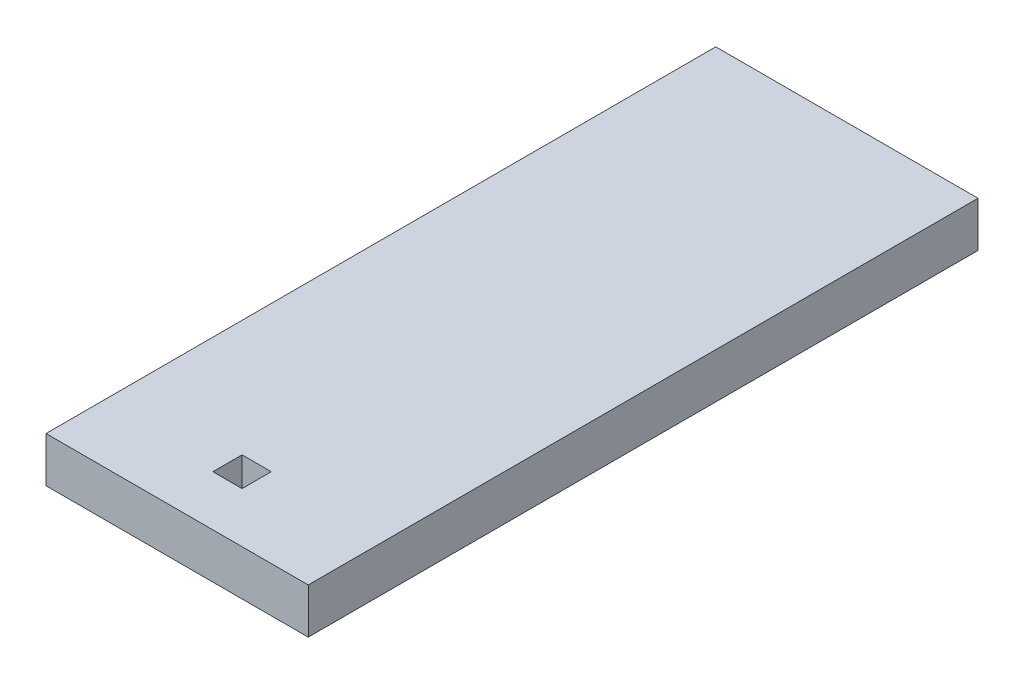
ISO-10303-21;
HEADER;
FILE_DESCRIPTION(('STEP AP214'),'2;1');
FILE_NAME('part.step','',(''),(''),'','','');
FILE_SCHEMA(('AUTOMOTIVE_DESIGN { 1 0 10303 214 1 1 1 1 }'));
ENDSEC;
DATA;
#1=APPLICATION_CONTEXT('core data for automotive mechanical design processes');
#2=APPLICATION_PROTOCOL_DEFINITION('international standard','automotive_design',2000,#1);
#3=PRODUCT_CONTEXT('',#1,'mechanical');
#4=PRODUCT('Part','Part','',(#3));
#5=PRODUCT_RELATED_PRODUCT_CATEGORY('part','',(#4));
#6=PRODUCT_DEFINITION_FORMATION('','',#4);
#7=PRODUCT_DEFINITION_CONTEXT('part definition',#1,'design');
#8=PRODUCT_DEFINITION('design','',#6,#7);
#9=PRODUCT_DEFINITION_SHAPE('','',#8);
#10=(LENGTH_UNIT() NAMED_UNIT(*) SI_UNIT(.MILLI.,.METRE.));
#11=(NAMED_UNIT(*) PLANE_ANGLE_UNIT() SI_UNIT($,.RADIAN.));
#12=(NAMED_UNIT(*) SI_UNIT($,.STERADIAN.) SOLID_ANGLE_UNIT());
#13=UNCERTAINTY_MEASURE_WITH_UNIT(LENGTH_MEASURE(1.E-05),#10,'distance_accuracy_value','');
#14=(GEOMETRIC_REPRESENTATION_CONTEXT(3) GLOBAL_UNCERTAINTY_ASSIGNED_CONTEXT((#13)) GLOBAL_UNIT_ASSIGNED_CONTEXT((#10,
#11,#12)) REPRESENTATION_CONTEXT('',''));
#15=CARTESIAN_POINT('',(0.,0.,0.));
#16=DIRECTION('',(0.,0.,1.));
#17=DIRECTION('',(1.,0.,0.));
#18=AXIS2_PLACEMENT_3D('',#15,#16,#17);
#19=CARTESIAN_POINT('',(0.,3.175,17.91424342));
#20=DIRECTION('',(0.,0.,-1.));
#21=DIRECTION('',(-1.,0.,0.));
#22=AXIS2_PLACEMENT_3D('',#19,#20,#21);
#23=PLANE('',#22);
#24=DIRECTION('',(1.,0.,0.));
#25=VECTOR('',#24,1.);
#26=CARTESIAN_POINT('',(0.,0.,17.91424342));
#27=LINE('',#26,#25);
#28=CARTESIAN_POINT('',(-1.025,0.,17.91424342));
#29=VERTEX_POINT('',#28);
#30=CARTESIAN_POINT('',(1.025,0.,17.91424342));
#31=VERTEX_POINT('',#30);
#32=EDGE_CURVE('E141',#29,#31,#27,.T.);
#33=ORIENTED_EDGE('',*,*,#32,.T.);
#34=DIRECTION('',(0.,-1.,0.));
#35=VECTOR('',#34,1.);
#36=CARTESIAN_POINT('',(1.025,3.175,17.91424342));
#37=LINE('',#36,#35);
#38=CARTESIAN_POINT('',(1.025,3.175,17.91424342));
#39=VERTEX_POINT('',#38);
#40=EDGE_CURVE('E11',#39,#31,#37,.T.);
#41=ORIENTED_EDGE('',*,*,#40,.F.);
#42=DIRECTION('',(1.,0.,0.));
#43=VECTOR('',#42,1.);
#44=CARTESIAN_POINT('',(0.,3.175,17.91424342));
#45=LINE('',#44,#43);
#46=CARTESIAN_POINT('',(-1.025,3.175,17.91424342));
#47=VERTEX_POINT('',#46);
#48=EDGE_CURVE('E115',#47,#39,#45,.T.);
#49=ORIENTED_EDGE('',*,*,#48,.F.);
#50=DIRECTION('',(0.,-1.,0.));
#51=VECTOR('',#50,1.);
#52=CARTESIAN_POINT('',(-1.025,3.175,17.91424342));
#53=LINE('',#52,#51);
#54=EDGE_CURVE('E62',#47,#29,#53,.T.);
#55=ORIENTED_EDGE('',*,*,#54,.T.);
#56=EDGE_LOOP('',(#33,#41,#49,#55));
#57=FACE_BOUND('',#56,.T.);
#58=ADVANCED_FACE('F36',(#57),#23,.F.);
#59=CARTESIAN_POINT('',(1.025,3.175,0.));
#60=DIRECTION('',(1.,0.,0.));
#61=DIRECTION('',(0.,0.,-1.));
#62=AXIS2_PLACEMENT_3D('',#59,#60,#61);
#63=PLANE('',#62);
#64=DIRECTION('',(0.,0.,1.));
#65=VECTOR('',#64,1.);
#66=CARTESIAN_POINT('',(1.025,0.,0.));
#67=LINE('',#66,#65);
#68=CARTESIAN_POINT('',(1.025,0.,19.96424342));
#69=VERTEX_POINT('',#68);
#70=EDGE_CURVE('E121',#31,#69,#67,.T.);
#71=ORIENTED_EDGE('',*,*,#70,.T.);
#72=DIRECTION('',(0.,-1.,0.));
#73=VECTOR('',#72,1.);
#74=CARTESIAN_POINT('',(1.025,3.175,19.96424342));
#75=LINE('',#74,#73);
#76=CARTESIAN_POINT('',(1.025,3.175,19.96424342));
#77=VERTEX_POINT('',#76);
#78=EDGE_CURVE('E45',#77,#69,#75,.T.);
#79=ORIENTED_EDGE('',*,*,#78,.F.);
#80=DIRECTION('',(0.,0.,1.));
#81=VECTOR('',#80,1.);
#82=CARTESIAN_POINT('',(1.025,3.175,0.));
#83=LINE('',#82,#81);
#84=EDGE_CURVE('E109',#39,#77,#83,.T.);
#85=ORIENTED_EDGE('',*,*,#84,.F.);
#86=ORIENTED_EDGE('',*,*,#40,.T.);
#87=EDGE_LOOP('',(#71,#79,#85,#86));
#88=FACE_BOUND('',#87,.T.);
#89=ADVANCED_FACE('F120',(#88),#63,.F.);
#90=CARTESIAN_POINT('',(0.,3.175,19.96424342));
#91=DIRECTION('',(0.,0.,-1.));
#92=DIRECTION('',(-1.,0.,0.));
#93=AXIS2_PLACEMENT_3D('',#90,#91,#92);
#94=PLANE('',#93);
#95=DIRECTION('',(1.,0.,0.));
#96=VECTOR('',#95,1.);
#97=CARTESIAN_POINT('',(0.,0.,19.96424342));
#98=LINE('',#97,#96);
#99=CARTESIAN_POINT('',(-1.025,0.,19.96424342));
#100=VERTEX_POINT('',#99);
#101=EDGE_CURVE('E144',#100,#69,#98,.T.);
#102=ORIENTED_EDGE('',*,*,#101,.F.);
#103=DIRECTION('',(0.,-1.,0.));
#104=VECTOR('',#103,1.);
#105=CARTESIAN_POINT('',(-1.025,3.175,19.96424342));
#106=LINE('',#105,#104);
#107=CARTESIAN_POINT('',(-1.025,3.175,19.96424342));
#108=VERTEX_POINT('',#107);
#109=EDGE_CURVE('E125',#108,#100,#106,.T.);
#110=ORIENTED_EDGE('',*,*,#109,.F.);
#111=DIRECTION('',(1.,0.,0.));
#112=VECTOR('',#111,1.);
#113=CARTESIAN_POINT('',(0.,3.175,19.96424342));
#114=LINE('',#113,#112);
#115=EDGE_CURVE('E114',#108,#77,#114,.T.);
#116=ORIENTED_EDGE('',*,*,#115,.T.);
#117=ORIENTED_EDGE('',*,*,#78,.T.);
#118=EDGE_LOOP('',(#102,#110,#116,#117));
#119=FACE_BOUND('',#118,.T.);
#120=ADVANCED_FACE('F127',(#119),#94,.T.);
#121=CARTESIAN_POINT('',(9.2,3.175,0.));
#122=DIRECTION('',(1.,0.,0.));
#123=DIRECTION('',(0.,0.,-1.));
#124=AXIS2_PLACEMENT_3D('',#121,#122,#123);
#125=PLANE('',#124);
#126=DIRECTION('',(0.,0.,1.));
#127=VECTOR('',#126,1.);
#128=CARTESIAN_POINT('',(9.2,0.,0.));
#129=LINE('',#128,#127);
#130=CARTESIAN_POINT('',(9.2,0.,-23.495));
#131=VERTEX_POINT('',#130);
#132=CARTESIAN_POINT('',(9.2,0.,23.495));
#133=VERTEX_POINT('',#132);
#134=EDGE_CURVE('E134',#131,#133,#129,.T.);
#135=ORIENTED_EDGE('',*,*,#134,.F.);
#136=DIRECTION('',(0.,-1.,0.));
#137=VECTOR('',#136,1.);
#138=CARTESIAN_POINT('',(9.2,3.175,-23.495));
#139=LINE('',#138,#137);
#140=CARTESIAN_POINT('',(9.2,3.175,-23.495));
#141=VERTEX_POINT('',#140);
#142=EDGE_CURVE('E40',#141,#131,#139,.T.);
#143=ORIENTED_EDGE('',*,*,#142,.F.);
#144=DIRECTION('',(0.,0.,1.));
#145=VECTOR('',#144,1.);
#146=CARTESIAN_POINT('',(9.2,3.175,0.));
#147=LINE('',#146,#145);
#148=CARTESIAN_POINT('',(9.2,3.175,23.495));
#149=VERTEX_POINT('',#148);
#150=EDGE_CURVE('E149',#141,#149,#147,.T.);
#151=ORIENTED_EDGE('',*,*,#150,.T.);
#152=DIRECTION('',(0.,-1.,0.));
#153=VECTOR('',#152,1.);
#154=CARTESIAN_POINT('',(9.2,3.175,23.495));
#155=LINE('',#154,#153);
#156=EDGE_CURVE('E130',#149,#133,#155,.T.);
#157=ORIENTED_EDGE('',*,*,#156,.T.);
#158=EDGE_LOOP('',(#135,#143,#151,#157));
#159=FACE_BOUND('',#158,.T.);
#160=ADVANCED_FACE('F38',(#159),#125,.T.);
#161=CARTESIAN_POINT('',(0.,3.175,-23.495));
#162=DIRECTION('',(0.,0.,-1.));
#163=DIRECTION('',(-1.,0.,0.));
#164=AXIS2_PLACEMENT_3D('',#161,#162,#163);
#165=PLANE('',#164);
#166=DIRECTION('',(0.,1.,0.));
#167=VECTOR('',#166,1.);
#168=CARTESIAN_POINT('',(-9.2,0.,-23.495));
#169=LINE('',#168,#167);
#170=CARTESIAN_POINT('',(-9.2,0.,-23.495));
#171=VERTEX_POINT('',#170);
#172=CARTESIAN_POINT('',(-9.2,3.175,-23.495));
#173=VERTEX_POINT('',#172);
#174=EDGE_CURVE('E53',#171,#173,#169,.T.);
#175=ORIENTED_EDGE('',*,*,#174,.T.);
#176=DIRECTION('',(1.,0.,0.));
#177=VECTOR('',#176,1.);
#178=CARTESIAN_POINT('',(0.,3.175,-23.495));
#179=LINE('',#178,#177);
#180=EDGE_CURVE('E95',#173,#141,#179,.T.);
#181=ORIENTED_EDGE('',*,*,#180,.T.);
#182=ORIENTED_EDGE('',*,*,#142,.T.);
#183=DIRECTION('',(1.,0.,0.));
#184=VECTOR('',#183,1.);
#185=CARTESIAN_POINT('',(0.,0.,-23.495));
#186=LINE('',#185,#184);
#187=EDGE_CURVE('E137',#171,#131,#186,.T.);
#188=ORIENTED_EDGE('',*,*,#187,.F.);
#189=EDGE_LOOP('',(#175,#181,#182,#188));
#190=FACE_BOUND('',#189,.T.);
#191=ADVANCED_FACE('F157',(#190),#165,.T.);
#192=CARTESIAN_POINT('',(0.,3.175,23.495));
#193=DIRECTION('',(0.,0.,-1.));
#194=DIRECTION('',(-1.,0.,0.));
#195=AXIS2_PLACEMENT_3D('',#192,#193,#194);
#196=PLANE('',#195);
#197=DIRECTION('',(1.,0.,0.));
#198=VECTOR('',#197,1.);
#199=CARTESIAN_POINT('',(0.,3.175,23.495));
#200=LINE('',#199,#198);
#201=CARTESIAN_POINT('',(-9.19999999999999,3.175,23.495));
#202=VERTEX_POINT('',#201);
#203=EDGE_CURVE('E175',#202,#149,#200,.T.);
#204=ORIENTED_EDGE('',*,*,#203,.F.);
#205=DIRECTION('',(0.,1.,0.));
#206=VECTOR('',#205,1.);
#207=CARTESIAN_POINT('',(-9.19999999999999,0.,23.495));
#208=LINE('',#207,#206);
#209=CARTESIAN_POINT('',(-9.19999999999999,0.,23.495));
#210=VERTEX_POINT('',#209);
#211=EDGE_CURVE('E166',#210,#202,#208,.T.);
#212=ORIENTED_EDGE('',*,*,#211,.F.);
#213=DIRECTION('',(1.,0.,0.));
#214=VECTOR('',#213,1.);
#215=CARTESIAN_POINT('',(0.,0.,23.495));
#216=LINE('',#215,#214);
#217=EDGE_CURVE('E139',#210,#133,#216,.T.);
#218=ORIENTED_EDGE('',*,*,#217,.T.);
#219=ORIENTED_EDGE('',*,*,#156,.F.);
#220=EDGE_LOOP('',(#204,#212,#218,#219));
#221=FACE_BOUND('',#220,.T.);
#222=ADVANCED_FACE('F181',(#221),#196,.F.);
#223=CARTESIAN_POINT('',(-1.02500000000001,3.175,0.));
#224=DIRECTION('',(1.,0.,0.));
#225=DIRECTION('',(0.,0.,-1.));
#226=AXIS2_PLACEMENT_3D('',#223,#224,#225);
#227=PLANE('',#226);
#228=DIRECTION('',(0.,0.,1.));
#229=VECTOR('',#228,1.);
#230=CARTESIAN_POINT('',(-1.02500000000001,0.,0.));
#231=LINE('',#230,#229);
#232=EDGE_CURVE('E146',#29,#100,#231,.T.);
#233=ORIENTED_EDGE('',*,*,#232,.F.);
#234=ORIENTED_EDGE('',*,*,#54,.F.);
#235=DIRECTION('',(0.,0.,1.));
#236=VECTOR('',#235,1.);
#237=CARTESIAN_POINT('',(-1.02500000000001,3.175,0.));
#238=LINE('',#237,#236);
#239=EDGE_CURVE('E128',#47,#108,#238,.T.);
#240=ORIENTED_EDGE('',*,*,#239,.T.);
#241=ORIENTED_EDGE('',*,*,#109,.T.);
#242=EDGE_LOOP('',(#233,#234,#240,#241));
#243=FACE_BOUND('',#242,.T.);
#244=ADVANCED_FACE('F200',(#243),#227,.T.);
#245=CARTESIAN_POINT('',(0.,3.175,0.));
#246=DIRECTION('',(0.,1.,0.));
#247=DIRECTION('',(0.,0.,1.));
#248=AXIS2_PLACEMENT_3D('',#245,#246,#247);
#249=PLANE('',#248);
#250=DIRECTION('',(0.,0.,-1.));
#251=VECTOR('',#250,1.);
#252=CARTESIAN_POINT('',(-9.2,3.175,-23.495));
#253=LINE('',#252,#251);
#254=EDGE_CURVE('E167',#202,#173,#253,.T.);
#255=ORIENTED_EDGE('',*,*,#254,.F.);
#256=ORIENTED_EDGE('',*,*,#203,.T.);
#257=ORIENTED_EDGE('',*,*,#150,.F.);
#258=ORIENTED_EDGE('',*,*,#180,.F.);
#259=EDGE_LOOP('',(#255,#256,#257,#258));
#260=FACE_BOUND('',#259,.T.);
#261=ORIENTED_EDGE('',*,*,#48,.T.);
#262=ORIENTED_EDGE('',*,*,#84,.T.);
#263=ORIENTED_EDGE('',*,*,#115,.F.);
#264=ORIENTED_EDGE('',*,*,#239,.F.);
#265=EDGE_LOOP('',(#261,#262,#263,#264));
#266=FACE_BOUND('',#265,.T.);
#267=ADVANCED_FACE('F111',(#260,#266),#249,.T.);
#268=CARTESIAN_POINT('',(0.,0.,0.));
#269=DIRECTION('',(0.,1.,0.));
#270=DIRECTION('',(0.,0.,1.));
#271=AXIS2_PLACEMENT_3D('',#268,#269,#270);
#272=PLANE('',#271);
#273=ORIENTED_EDGE('',*,*,#217,.F.);
#274=DIRECTION('',(0.,0.,-1.));
#275=VECTOR('',#274,1.);
#276=CARTESIAN_POINT('',(-9.2,0.,-23.495));
#277=LINE('',#276,#275);
#278=EDGE_CURVE('E163',#210,#171,#277,.T.);
#279=ORIENTED_EDGE('',*,*,#278,.T.);
#280=ORIENTED_EDGE('',*,*,#187,.T.);
#281=ORIENTED_EDGE('',*,*,#134,.T.);
#282=EDGE_LOOP('',(#273,#279,#280,#281));
#283=FACE_BOUND('',#282,.T.);
#284=ORIENTED_EDGE('',*,*,#32,.F.);
#285=ORIENTED_EDGE('',*,*,#232,.T.);
#286=ORIENTED_EDGE('',*,*,#101,.T.);
#287=ORIENTED_EDGE('',*,*,#70,.F.);
#288=EDGE_LOOP('',(#284,#285,#286,#287));
#289=FACE_BOUND('',#288,.T.);
#290=ADVANCED_FACE('F161',(#283,#289),#272,.F.);
#291=CARTESIAN_POINT('',(-9.2,0.,-23.495));
#292=DIRECTION('',(1.,0.,0.));
#293=DIRECTION('',(0.,0.,-1.));
#294=AXIS2_PLACEMENT_3D('',#291,#292,#293);
#295=PLANE('',#294);
#296=ORIENTED_EDGE('',*,*,#254,.T.);
#297=ORIENTED_EDGE('',*,*,#174,.F.);
#298=ORIENTED_EDGE('',*,*,#278,.F.);
#299=ORIENTED_EDGE('',*,*,#211,.T.);
#300=EDGE_LOOP('',(#296,#297,#298,#299));
#301=FACE_BOUND('',#300,.T.);
#302=ADVANCED_FACE('F183',(#301),#295,.F.);
#303=CLOSED_SHELL('',(#58,#89,#120,#160,#191,#222,#244,#267,#290,#302));
#304=MANIFOLD_SOLID_BREP('B2',#303);
#305=ADVANCED_BREP_SHAPE_REPRESENTATION('',(#18,#304),#14);
#306=SHAPE_DEFINITION_REPRESENTATION(#9,#305);
ENDSEC;
END-ISO-10303-21;
